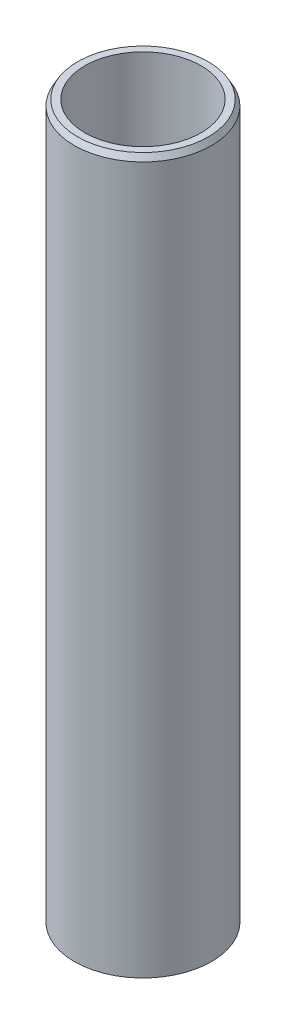
ISO-10303-21;
HEADER;
FILE_DESCRIPTION(('STEP AP214'),'2;1');
FILE_NAME('part.step','',(''),(''),'','','');
FILE_SCHEMA(('AUTOMOTIVE_DESIGN { 1 0 10303 214 1 1 1 1 }'));
ENDSEC;
DATA;
#1=APPLICATION_CONTEXT('core data for automotive mechanical design processes');
#2=APPLICATION_PROTOCOL_DEFINITION('international standard','automotive_design',2000,#1);
#3=PRODUCT_CONTEXT('',#1,'mechanical');
#4=PRODUCT('Part','Part','',(#3));
#5=PRODUCT_RELATED_PRODUCT_CATEGORY('part','',(#4));
#6=PRODUCT_DEFINITION_FORMATION('','',#4);
#7=PRODUCT_DEFINITION_CONTEXT('part definition',#1,'design');
#8=PRODUCT_DEFINITION('design','',#6,#7);
#9=PRODUCT_DEFINITION_SHAPE('','',#8);
#10=(LENGTH_UNIT() NAMED_UNIT(*) SI_UNIT(.MILLI.,.METRE.));
#11=(NAMED_UNIT(*) PLANE_ANGLE_UNIT() SI_UNIT($,.RADIAN.));
#12=(NAMED_UNIT(*) SI_UNIT($,.STERADIAN.) SOLID_ANGLE_UNIT());
#13=UNCERTAINTY_MEASURE_WITH_UNIT(LENGTH_MEASURE(1.E-05),#10,'distance_accuracy_value','');
#14=(GEOMETRIC_REPRESENTATION_CONTEXT(3) GLOBAL_UNCERTAINTY_ASSIGNED_CONTEXT((#13)) GLOBAL_UNIT_ASSIGNED_CONTEXT((#10,
#11,#12)) REPRESENTATION_CONTEXT('',''));
#15=CARTESIAN_POINT('',(0.,0.,0.));
#16=DIRECTION('',(0.,0.,1.));
#17=DIRECTION('',(1.,0.,0.));
#18=AXIS2_PLACEMENT_3D('',#15,#16,#17);
#19=CARTESIAN_POINT('',(0.,600.,0.));
#20=DIRECTION('',(0.,-1.,0.));
#21=DIRECTION('',(0.,0.,-1.));
#22=AXIS2_PLACEMENT_3D('',#19,#20,#21);
#23=CYLINDRICAL_SURFACE('',#22,57.5);
#24=CARTESIAN_POINT('',(0.,595.133083737229,0.));
#25=DIRECTION('',(0.,1.,0.));
#26=DIRECTION('',(0.,0.,1.));
#27=AXIS2_PLACEMENT_3D('',#24,#25,#26);
#28=CIRCLE('',#27,57.5);
#29=CARTESIAN_POINT('',(0.,595.133083737229,57.5));
#30=VERTEX_POINT('',#29);
#31=EDGE_CURVE('E50',#30,#30,#28,.F.);
#32=ORIENTED_EDGE('',*,*,#31,.T.);
#33=EDGE_LOOP('',(#32));
#34=FACE_BOUND('',#33,.T.);
#35=CARTESIAN_POINT('',(0.,2.80991541443421,0.));
#36=DIRECTION('',(0.,1.,0.));
#37=DIRECTION('',(0.,0.,1.));
#38=AXIS2_PLACEMENT_3D('',#35,#36,#37);
#39=CIRCLE('',#38,57.5);
#40=CARTESIAN_POINT('',(0.,2.80991541443421,57.5));
#41=VERTEX_POINT('',#40);
#42=EDGE_CURVE('E51',#41,#41,#39,.T.);
#43=ORIENTED_EDGE('',*,*,#42,.T.);
#44=EDGE_LOOP('',(#43));
#45=FACE_BOUND('',#44,.T.);
#46=ADVANCED_FACE('F39',(#34,#45),#23,.T.);
#47=CARTESIAN_POINT('',(0.,600.,0.));
#48=DIRECTION('',(0.,1.,0.));
#49=DIRECTION('',(0.,0.,1.));
#50=AXIS2_PLACEMENT_3D('',#47,#48,#49);
#51=PLANE('',#50);
#52=CARTESIAN_POINT('',(0.,600.,0.));
#53=DIRECTION('',(0.,1.,0.));
#54=DIRECTION('',(0.,0.,1.));
#55=AXIS2_PLACEMENT_3D('',#52,#53,#54);
#56=CIRCLE('',#55,54.6900845855657);
#57=CARTESIAN_POINT('',(0.,600.,54.6900845855657));
#58=VERTEX_POINT('',#57);
#59=EDGE_CURVE('E54',#58,#58,#56,.T.);
#60=ORIENTED_EDGE('',*,*,#59,.T.);
#61=EDGE_LOOP('',(#60));
#62=FACE_BOUND('',#61,.T.);
#63=CARTESIAN_POINT('',(0.,600.,0.));
#64=DIRECTION('',(0.,1.,0.));
#65=DIRECTION('',(0.,0.,1.));
#66=AXIS2_PLACEMENT_3D('',#63,#64,#65);
#67=CIRCLE('',#66,48.7226156263558);
#68=CARTESIAN_POINT('',(0.,600.,48.7226156263558));
#69=VERTEX_POINT('',#68);
#70=EDGE_CURVE('E58',#69,#69,#67,.T.);
#71=ORIENTED_EDGE('',*,*,#70,.F.);
#72=EDGE_LOOP('',(#71));
#73=FACE_BOUND('',#72,.T.);
#74=ADVANCED_FACE('F69',(#62,#73),#51,.T.);
#75=CARTESIAN_POINT('',(0.,0.,0.));
#76=DIRECTION('',(0.,1.,0.));
#77=DIRECTION('',(0.,0.,1.));
#78=AXIS2_PLACEMENT_3D('',#75,#76,#77);
#79=PLANE('',#78);
#80=CARTESIAN_POINT('',(0.,0.,0.));
#81=DIRECTION('',(0.,1.,0.));
#82=DIRECTION('',(0.,0.,1.));
#83=AXIS2_PLACEMENT_3D('',#80,#81,#82);
#84=CIRCLE('',#83,52.6330837372289);
#85=CARTESIAN_POINT('',(0.,0.,52.6330837372289));
#86=VERTEX_POINT('',#85);
#87=EDGE_CURVE('E10',#86,#86,#84,.F.);
#88=ORIENTED_EDGE('',*,*,#87,.T.);
#89=EDGE_LOOP('',(#88));
#90=FACE_BOUND('',#89,.T.);
#91=CARTESIAN_POINT('',(0.,0.,0.));
#92=DIRECTION('',(0.,1.,0.));
#93=DIRECTION('',(0.,0.,1.));
#94=AXIS2_PLACEMENT_3D('',#91,#92,#93);
#95=CIRCLE('',#94,48.7226156263558);
#96=CARTESIAN_POINT('',(0.,0.,48.7226156263558));
#97=VERTEX_POINT('',#96);
#98=EDGE_CURVE('E63',#97,#97,#95,.T.);
#99=ORIENTED_EDGE('',*,*,#98,.T.);
#100=EDGE_LOOP('',(#99));
#101=FACE_BOUND('',#100,.T.);
#102=ADVANCED_FACE('F75',(#90,#101),#79,.F.);
#103=CARTESIAN_POINT('',(0.,600.,0.));
#104=DIRECTION('',(0.,-1.,0.));
#105=DIRECTION('',(0.,0.,-1.));
#106=AXIS2_PLACEMENT_3D('',#103,#104,#105);
#107=CYLINDRICAL_SURFACE('',#106,48.7226156263558);
#108=ORIENTED_EDGE('',*,*,#70,.T.);
#109=EDGE_LOOP('',(#108));
#110=FACE_BOUND('',#109,.T.);
#111=ORIENTED_EDGE('',*,*,#98,.F.);
#112=EDGE_LOOP('',(#111));
#113=FACE_BOUND('',#112,.T.);
#114=ADVANCED_FACE('F70',(#110,#113),#107,.F.);
#115=CARTESIAN_POINT('',(0.,600.,0.));
#116=DIRECTION('',(0.,-1.,0.));
#117=DIRECTION('',(0.,0.,-1.));
#118=AXIS2_PLACEMENT_3D('',#115,#116,#117);
#119=CONICAL_SURFACE('',#118,54.6900845855657,0.523598775598295);
#120=ORIENTED_EDGE('',*,*,#31,.F.);
#121=EDGE_LOOP('',(#120));
#122=FACE_BOUND('',#121,.T.);
#123=ORIENTED_EDGE('',*,*,#59,.F.);
#124=EDGE_LOOP('',(#123));
#125=FACE_BOUND('',#124,.T.);
#126=ADVANCED_FACE('F81',(#122,#125),#119,.T.);
#127=CARTESIAN_POINT('',(0.,2.80991541443421,0.));
#128=DIRECTION('',(0.,1.,0.));
#129=DIRECTION('',(0.,0.,1.));
#130=AXIS2_PLACEMENT_3D('',#127,#128,#129);
#131=CONICAL_SURFACE('',#130,57.5,1.04719755119661);
#132=ORIENTED_EDGE('',*,*,#87,.F.);
#133=EDGE_LOOP('',(#132));
#134=FACE_BOUND('',#133,.T.);
#135=ORIENTED_EDGE('',*,*,#42,.F.);
#136=EDGE_LOOP('',(#135));
#137=FACE_BOUND('',#136,.T.);
#138=ADVANCED_FACE('F45',(#134,#137),#131,.T.);
#139=CLOSED_SHELL('',(#46,#74,#102,#114,#126,#138));
#140=MANIFOLD_SOLID_BREP('B2',#139);
#141=ADVANCED_BREP_SHAPE_REPRESENTATION('',(#18,#140),#14);
#142=SHAPE_DEFINITION_REPRESENTATION(#9,#141);
ENDSEC;
END-ISO-10303-21;
